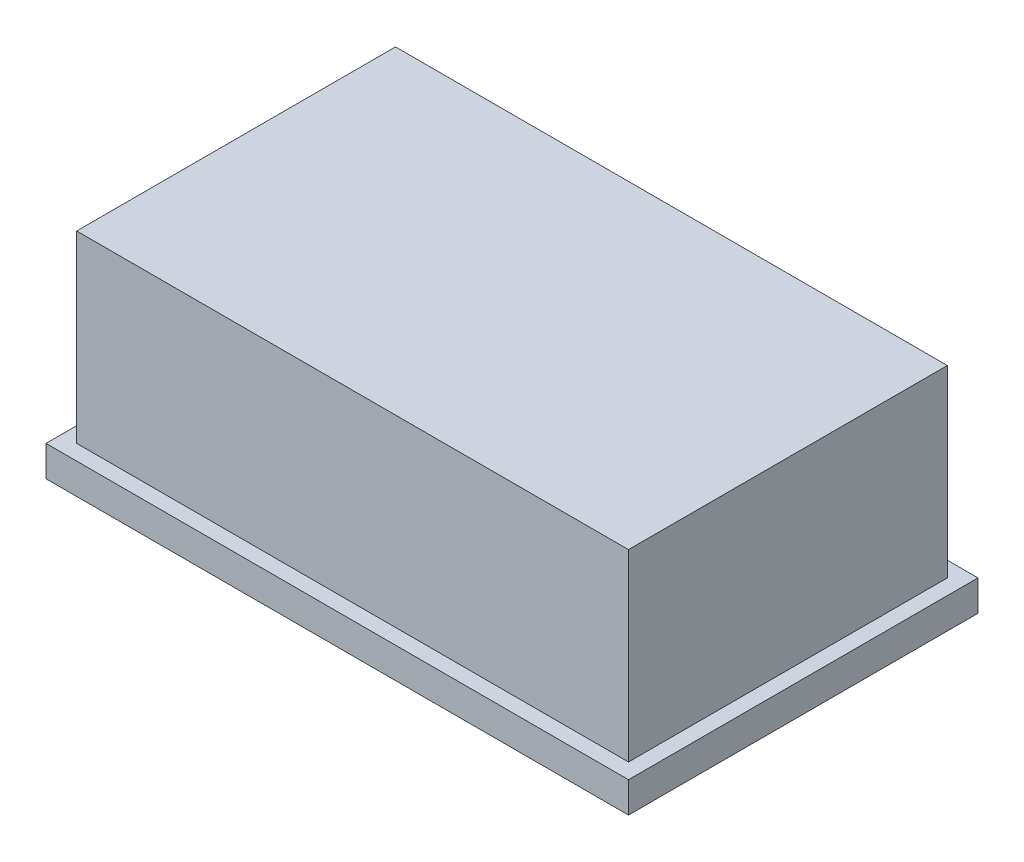
ISO-10303-21;
HEADER;
FILE_DESCRIPTION(('STEP AP214'),'2;1');
FILE_NAME('part.step','',(''),(''),'','','');
FILE_SCHEMA(('AUTOMOTIVE_DESIGN { 1 0 10303 214 1 1 1 1 }'));
ENDSEC;
DATA;
#1=APPLICATION_CONTEXT('core data for automotive mechanical design processes');
#2=APPLICATION_PROTOCOL_DEFINITION('international standard','automotive_design',2000,#1);
#3=PRODUCT_CONTEXT('',#1,'mechanical');
#4=PRODUCT('Part','Part','',(#3));
#5=PRODUCT_RELATED_PRODUCT_CATEGORY('part','',(#4));
#6=PRODUCT_DEFINITION_FORMATION('','',#4);
#7=PRODUCT_DEFINITION_CONTEXT('part definition',#1,'design');
#8=PRODUCT_DEFINITION('design','',#6,#7);
#9=PRODUCT_DEFINITION_SHAPE('','',#8);
#10=(LENGTH_UNIT() NAMED_UNIT(*) SI_UNIT(.MILLI.,.METRE.));
#11=(NAMED_UNIT(*) PLANE_ANGLE_UNIT() SI_UNIT($,.RADIAN.));
#12=(NAMED_UNIT(*) SI_UNIT($,.STERADIAN.) SOLID_ANGLE_UNIT());
#13=UNCERTAINTY_MEASURE_WITH_UNIT(LENGTH_MEASURE(1.E-05),#10,'distance_accuracy_value','');
#14=(GEOMETRIC_REPRESENTATION_CONTEXT(3) GLOBAL_UNCERTAINTY_ASSIGNED_CONTEXT((#13)) GLOBAL_UNIT_ASSIGNED_CONTEXT((#10,
#11,#12)) REPRESENTATION_CONTEXT('',''));
#15=CARTESIAN_POINT('',(0.,0.,0.));
#16=DIRECTION('',(0.,0.,1.));
#17=DIRECTION('',(1.,0.,0.));
#18=AXIS2_PLACEMENT_3D('',#15,#16,#17);
#19=CARTESIAN_POINT('',(0.,2.5,0.));
#20=DIRECTION('',(0.,-1.,0.));
#21=DIRECTION('',(0.,0.,-1.));
#22=AXIS2_PLACEMENT_3D('',#19,#20,#21);
#23=PLANE('',#22);
#24=DIRECTION('',(0.,0.,1.));
#25=VECTOR('',#24,1.);
#26=CARTESIAN_POINT('',(0.,2.5,0.));
#27=LINE('',#26,#25);
#28=CARTESIAN_POINT('',(0.,2.5,-28.5));
#29=VERTEX_POINT('',#28);
#30=CARTESIAN_POINT('',(0.,2.5,0.));
#31=VERTEX_POINT('',#30);
#32=EDGE_CURVE('E236',#29,#31,#27,.T.);
#33=ORIENTED_EDGE('',*,*,#32,.T.);
#34=DIRECTION('',(1.,0.,0.));
#35=VECTOR('',#34,1.);
#36=CARTESIAN_POINT('',(0.,2.5,0.));
#37=LINE('',#36,#35);
#38=CARTESIAN_POINT('',(47.5,2.5,0.));
#39=VERTEX_POINT('',#38);
#40=EDGE_CURVE('E240',#31,#39,#37,.T.);
#41=ORIENTED_EDGE('',*,*,#40,.T.);
#42=DIRECTION('',(0.,0.,-1.));
#43=VECTOR('',#42,1.);
#44=CARTESIAN_POINT('',(47.5,2.5,0.));
#45=LINE('',#44,#43);
#46=CARTESIAN_POINT('',(47.5,2.5,-28.5));
#47=VERTEX_POINT('',#46);
#48=EDGE_CURVE('E244',#39,#47,#45,.T.);
#49=ORIENTED_EDGE('',*,*,#48,.T.);
#50=DIRECTION('',(-1.,0.,0.));
#51=VECTOR('',#50,1.);
#52=CARTESIAN_POINT('',(0.,2.5,-28.5));
#53=LINE('',#52,#51);
#54=EDGE_CURVE('E247',#47,#29,#53,.T.);
#55=ORIENTED_EDGE('',*,*,#54,.T.);
#56=EDGE_LOOP('',(#33,#41,#49,#55));
#57=FACE_BOUND('',#56,.T.);
#58=DIRECTION('',(0.,0.,-1.));
#59=VECTOR('',#58,1.);
#60=CARTESIAN_POINT('',(46.25,2.5,-1.25));
#61=LINE('',#60,#59);
#62=CARTESIAN_POINT('',(46.25,2.5,-1.25));
#63=VERTEX_POINT('',#62);
#64=CARTESIAN_POINT('',(46.25,2.5,-27.25));
#65=VERTEX_POINT('',#64);
#66=EDGE_CURVE('E185',#63,#65,#61,.T.);
#67=ORIENTED_EDGE('',*,*,#66,.F.);
#68=DIRECTION('',(1.,0.,0.));
#69=VECTOR('',#68,1.);
#70=CARTESIAN_POINT('',(1.24999999999999,2.5,-1.25));
#71=LINE('',#70,#69);
#72=CARTESIAN_POINT('',(1.24999999999999,2.5,-1.25));
#73=VERTEX_POINT('',#72);
#74=EDGE_CURVE('E196',#73,#63,#71,.T.);
#75=ORIENTED_EDGE('',*,*,#74,.F.);
#76=DIRECTION('',(0.,0.,1.));
#77=VECTOR('',#76,1.);
#78=CARTESIAN_POINT('',(1.24999999999999,2.5,-1.25));
#79=LINE('',#78,#77);
#80=CARTESIAN_POINT('',(1.24999999999999,2.5,-27.25));
#81=VERTEX_POINT('',#80);
#82=EDGE_CURVE('E213',#81,#73,#79,.T.);
#83=ORIENTED_EDGE('',*,*,#82,.F.);
#84=DIRECTION('',(-1.,0.,0.));
#85=VECTOR('',#84,1.);
#86=CARTESIAN_POINT('',(1.24999999999999,2.5,-27.25));
#87=LINE('',#86,#85);
#88=EDGE_CURVE('E209',#65,#81,#87,.T.);
#89=ORIENTED_EDGE('',*,*,#88,.F.);
#90=EDGE_LOOP('',(#67,#75,#83,#89));
#91=FACE_BOUND('',#90,.T.);
#92=ADVANCED_FACE('F45',(#57,#91),#23,.F.);
#93=CARTESIAN_POINT('',(0.,2.5,0.));
#94=DIRECTION('',(1.,0.,0.));
#95=DIRECTION('',(0.,0.,-1.));
#96=AXIS2_PLACEMENT_3D('',#93,#94,#95);
#97=PLANE('',#96);
#98=DIRECTION('',(0.,0.,1.));
#99=VECTOR('',#98,1.);
#100=CARTESIAN_POINT('',(0.,0.,0.));
#101=LINE('',#100,#99);
#102=CARTESIAN_POINT('',(0.,0.,-28.5));
#103=VERTEX_POINT('',#102);
#104=CARTESIAN_POINT('',(0.,0.,0.));
#105=VERTEX_POINT('',#104);
#106=EDGE_CURVE('E235',#103,#105,#101,.T.);
#107=ORIENTED_EDGE('',*,*,#106,.T.);
#108=DIRECTION('',(0.,-1.,0.));
#109=VECTOR('',#108,1.);
#110=CARTESIAN_POINT('',(0.,2.5,0.));
#111=LINE('',#110,#109);
#112=EDGE_CURVE('E273',#31,#105,#111,.T.);
#113=ORIENTED_EDGE('',*,*,#112,.F.);
#114=ORIENTED_EDGE('',*,*,#32,.F.);
#115=DIRECTION('',(0.,-1.,0.));
#116=VECTOR('',#115,1.);
#117=CARTESIAN_POINT('',(0.,2.5,-28.5));
#118=LINE('',#117,#116);
#119=EDGE_CURVE('E250',#29,#103,#118,.T.);
#120=ORIENTED_EDGE('',*,*,#119,.T.);
#121=EDGE_LOOP('',(#107,#113,#114,#120));
#122=FACE_BOUND('',#121,.T.);
#123=ADVANCED_FACE('F329',(#122),#97,.F.);
#124=CARTESIAN_POINT('',(0.,2.5,0.));
#125=DIRECTION('',(0.,0.,-1.));
#126=DIRECTION('',(-1.,0.,0.));
#127=AXIS2_PLACEMENT_3D('',#124,#125,#126);
#128=PLANE('',#127);
#129=DIRECTION('',(1.,0.,0.));
#130=VECTOR('',#129,1.);
#131=CARTESIAN_POINT('',(0.,0.,0.));
#132=LINE('',#131,#130);
#133=CARTESIAN_POINT('',(47.5,0.,0.));
#134=VERTEX_POINT('',#133);
#135=EDGE_CURVE('E254',#105,#134,#132,.T.);
#136=ORIENTED_EDGE('',*,*,#135,.T.);
#137=DIRECTION('',(0.,-1.,0.));
#138=VECTOR('',#137,1.);
#139=CARTESIAN_POINT('',(47.5,2.5,0.));
#140=LINE('',#139,#138);
#141=EDGE_CURVE('E269',#39,#134,#140,.T.);
#142=ORIENTED_EDGE('',*,*,#141,.F.);
#143=ORIENTED_EDGE('',*,*,#40,.F.);
#144=ORIENTED_EDGE('',*,*,#112,.T.);
#145=EDGE_LOOP('',(#136,#142,#143,#144));
#146=FACE_BOUND('',#145,.T.);
#147=ADVANCED_FACE('F335',(#146),#128,.F.);
#148=CARTESIAN_POINT('',(47.5,2.5,0.));
#149=DIRECTION('',(-1.,0.,0.));
#150=DIRECTION('',(0.,0.,1.));
#151=AXIS2_PLACEMENT_3D('',#148,#149,#150);
#152=PLANE('',#151);
#153=DIRECTION('',(0.,0.,-1.));
#154=VECTOR('',#153,1.);
#155=CARTESIAN_POINT('',(47.5,0.,0.));
#156=LINE('',#155,#154);
#157=CARTESIAN_POINT('',(47.5,0.,-28.5));
#158=VERTEX_POINT('',#157);
#159=EDGE_CURVE('E257',#134,#158,#156,.T.);
#160=ORIENTED_EDGE('',*,*,#159,.T.);
#161=DIRECTION('',(0.,-1.,0.));
#162=VECTOR('',#161,1.);
#163=CARTESIAN_POINT('',(47.5,2.5,-28.5));
#164=LINE('',#163,#162);
#165=EDGE_CURVE('E265',#47,#158,#164,.T.);
#166=ORIENTED_EDGE('',*,*,#165,.F.);
#167=ORIENTED_EDGE('',*,*,#48,.F.);
#168=ORIENTED_EDGE('',*,*,#141,.T.);
#169=EDGE_LOOP('',(#160,#166,#167,#168));
#170=FACE_BOUND('',#169,.T.);
#171=ADVANCED_FACE('F350',(#170),#152,.F.);
#172=CARTESIAN_POINT('',(0.,2.5,-28.5));
#173=DIRECTION('',(0.,0.,1.));
#174=DIRECTION('',(1.,0.,0.));
#175=AXIS2_PLACEMENT_3D('',#172,#173,#174);
#176=PLANE('',#175);
#177=DIRECTION('',(-1.,0.,0.));
#178=VECTOR('',#177,1.);
#179=CARTESIAN_POINT('',(0.,0.,-28.5));
#180=LINE('',#179,#178);
#181=EDGE_CURVE('E241',#158,#103,#180,.T.);
#182=ORIENTED_EDGE('',*,*,#181,.T.);
#183=ORIENTED_EDGE('',*,*,#119,.F.);
#184=ORIENTED_EDGE('',*,*,#54,.F.);
#185=ORIENTED_EDGE('',*,*,#165,.T.);
#186=EDGE_LOOP('',(#182,#183,#184,#185));
#187=FACE_BOUND('',#186,.T.);
#188=ADVANCED_FACE('F346',(#187),#176,.F.);
#189=CARTESIAN_POINT('',(0.,0.,0.));
#190=DIRECTION('',(0.,-1.,0.));
#191=DIRECTION('',(0.,0.,-1.));
#192=AXIS2_PLACEMENT_3D('',#189,#190,#191);
#193=PLANE('',#192);
#194=DIRECTION('',(1.,0.,0.));
#195=VECTOR('',#194,1.);
#196=CARTESIAN_POINT('',(41.75,0.,-3.24999999999999));
#197=LINE('',#196,#195);
#198=CARTESIAN_POINT('',(3.74999999999999,0.,-3.24999999999999));
#199=VERTEX_POINT('',#198);
#200=CARTESIAN_POINT('',(43.75,0.,-3.24999999999999));
#201=VERTEX_POINT('',#200);
#202=EDGE_CURVE('E279',#199,#201,#197,.T.);
#203=ORIENTED_EDGE('',*,*,#202,.T.);
#204=DIRECTION('',(0.,0.,-1.));
#205=VECTOR('',#204,1.);
#206=CARTESIAN_POINT('',(43.75,0.,-23.25));
#207=LINE('',#206,#205);
#208=CARTESIAN_POINT('',(43.75,0.,-25.25));
#209=VERTEX_POINT('',#208);
#210=EDGE_CURVE('E288',#201,#209,#207,.T.);
#211=ORIENTED_EDGE('',*,*,#210,.T.);
#212=DIRECTION('',(-1.,0.,0.));
#213=VECTOR('',#212,1.);
#214=CARTESIAN_POINT('',(5.75,0.,-25.25));
#215=LINE('',#214,#213);
#216=CARTESIAN_POINT('',(3.74999999999999,0.,-25.25));
#217=VERTEX_POINT('',#216);
#218=EDGE_CURVE('E285',#209,#217,#215,.T.);
#219=ORIENTED_EDGE('',*,*,#218,.T.);
#220=DIRECTION('',(0.,0.,1.));
#221=VECTOR('',#220,1.);
#222=CARTESIAN_POINT('',(3.74999999999999,0.,-5.25));
#223=LINE('',#222,#221);
#224=EDGE_CURVE('E282',#217,#199,#223,.T.);
#225=ORIENTED_EDGE('',*,*,#224,.T.);
#226=EDGE_LOOP('',(#203,#211,#219,#225));
#227=FACE_BOUND('',#226,.T.);
#228=ORIENTED_EDGE('',*,*,#106,.F.);
#229=ORIENTED_EDGE('',*,*,#181,.F.);
#230=ORIENTED_EDGE('',*,*,#159,.F.);
#231=ORIENTED_EDGE('',*,*,#135,.F.);
#232=EDGE_LOOP('',(#228,#229,#230,#231));
#233=FACE_BOUND('',#232,.T.);
#234=ADVANCED_FACE('F343',(#227,#233),#193,.T.);
#235=CARTESIAN_POINT('',(46.25,17.5,-1.25));
#236=DIRECTION('',(-1.,0.,0.));
#237=DIRECTION('',(0.,0.,1.));
#238=AXIS2_PLACEMENT_3D('',#235,#236,#237);
#239=PLANE('',#238);
#240=ORIENTED_EDGE('',*,*,#66,.T.);
#241=DIRECTION('',(0.,-1.,0.));
#242=VECTOR('',#241,1.);
#243=CARTESIAN_POINT('',(46.25,17.5,-27.25));
#244=LINE('',#243,#242);
#245=CARTESIAN_POINT('',(46.25,17.5,-27.25));
#246=VERTEX_POINT('',#245);
#247=EDGE_CURVE('E231',#246,#65,#244,.T.);
#248=ORIENTED_EDGE('',*,*,#247,.F.);
#249=DIRECTION('',(0.,0.,-1.));
#250=VECTOR('',#249,1.);
#251=CARTESIAN_POINT('',(46.25,17.5,-1.25));
#252=LINE('',#251,#250);
#253=CARTESIAN_POINT('',(46.25,17.5,-1.25));
#254=VERTEX_POINT('',#253);
#255=EDGE_CURVE('E191',#254,#246,#252,.T.);
#256=ORIENTED_EDGE('',*,*,#255,.F.);
#257=DIRECTION('',(0.,-1.,0.));
#258=VECTOR('',#257,1.);
#259=CARTESIAN_POINT('',(46.25,17.5,-1.25));
#260=LINE('',#259,#258);
#261=EDGE_CURVE('E205',#254,#63,#260,.T.);
#262=ORIENTED_EDGE('',*,*,#261,.T.);
#263=EDGE_LOOP('',(#240,#248,#256,#262));
#264=FACE_BOUND('',#263,.T.);
#265=ADVANCED_FACE('F341',(#264),#239,.F.);
#266=CARTESIAN_POINT('',(1.24999999999999,17.5,-27.25));
#267=DIRECTION('',(0.,0.,1.));
#268=DIRECTION('',(1.,0.,0.));
#269=AXIS2_PLACEMENT_3D('',#266,#267,#268);
#270=PLANE('',#269);
#271=ORIENTED_EDGE('',*,*,#88,.T.);
#272=DIRECTION('',(0.,-1.,0.));
#273=VECTOR('',#272,1.);
#274=CARTESIAN_POINT('',(1.24999999999999,17.5,-27.25));
#275=LINE('',#274,#273);
#276=CARTESIAN_POINT('',(1.24999999999999,17.5,-27.25));
#277=VERTEX_POINT('',#276);
#278=EDGE_CURVE('E227',#277,#81,#275,.T.);
#279=ORIENTED_EDGE('',*,*,#278,.F.);
#280=DIRECTION('',(-1.,0.,0.));
#281=VECTOR('',#280,1.);
#282=CARTESIAN_POINT('',(1.24999999999999,17.5,-27.25));
#283=LINE('',#282,#281);
#284=EDGE_CURVE('E195',#246,#277,#283,.T.);
#285=ORIENTED_EDGE('',*,*,#284,.F.);
#286=ORIENTED_EDGE('',*,*,#247,.T.);
#287=EDGE_LOOP('',(#271,#279,#285,#286));
#288=FACE_BOUND('',#287,.T.);
#289=ADVANCED_FACE('F471',(#288),#270,.F.);
#290=CARTESIAN_POINT('',(1.24999999999999,17.5,-1.25));
#291=DIRECTION('',(1.,0.,0.));
#292=DIRECTION('',(0.,0.,-1.));
#293=AXIS2_PLACEMENT_3D('',#290,#291,#292);
#294=PLANE('',#293);
#295=ORIENTED_EDGE('',*,*,#82,.T.);
#296=DIRECTION('',(0.,-1.,0.));
#297=VECTOR('',#296,1.);
#298=CARTESIAN_POINT('',(1.24999999999999,17.5,-1.25));
#299=LINE('',#298,#297);
#300=CARTESIAN_POINT('',(1.24999999999999,17.5,-1.25));
#301=VERTEX_POINT('',#300);
#302=EDGE_CURVE('E223',#301,#73,#299,.T.);
#303=ORIENTED_EDGE('',*,*,#302,.F.);
#304=DIRECTION('',(0.,0.,1.));
#305=VECTOR('',#304,1.);
#306=CARTESIAN_POINT('',(1.24999999999999,17.5,-1.25));
#307=LINE('',#306,#305);
#308=EDGE_CURVE('E199',#277,#301,#307,.T.);
#309=ORIENTED_EDGE('',*,*,#308,.F.);
#310=ORIENTED_EDGE('',*,*,#278,.T.);
#311=EDGE_LOOP('',(#295,#303,#309,#310));
#312=FACE_BOUND('',#311,.T.);
#313=ADVANCED_FACE('F461',(#312),#294,.F.);
#314=CARTESIAN_POINT('',(1.24999999999999,17.5,-1.25));
#315=DIRECTION('',(0.,0.,-1.));
#316=DIRECTION('',(-1.,0.,0.));
#317=AXIS2_PLACEMENT_3D('',#314,#315,#316);
#318=PLANE('',#317);
#319=ORIENTED_EDGE('',*,*,#74,.T.);
#320=ORIENTED_EDGE('',*,*,#261,.F.);
#321=DIRECTION('',(1.,0.,0.));
#322=VECTOR('',#321,1.);
#323=CARTESIAN_POINT('',(1.24999999999999,17.5,-1.25));
#324=LINE('',#323,#322);
#325=EDGE_CURVE('E202',#301,#254,#324,.T.);
#326=ORIENTED_EDGE('',*,*,#325,.F.);
#327=ORIENTED_EDGE('',*,*,#302,.T.);
#328=EDGE_LOOP('',(#319,#320,#326,#327));
#329=FACE_BOUND('',#328,.T.);
#330=ADVANCED_FACE('F452',(#329),#318,.F.);
#331=CARTESIAN_POINT('',(0.,17.5,0.));
#332=DIRECTION('',(0.,-1.,0.));
#333=DIRECTION('',(0.,0.,-1.));
#334=AXIS2_PLACEMENT_3D('',#331,#332,#333);
#335=PLANE('',#334);
#336=ORIENTED_EDGE('',*,*,#255,.T.);
#337=ORIENTED_EDGE('',*,*,#284,.T.);
#338=ORIENTED_EDGE('',*,*,#308,.T.);
#339=ORIENTED_EDGE('',*,*,#325,.T.);
#340=EDGE_LOOP('',(#336,#337,#338,#339));
#341=FACE_BOUND('',#340,.T.);
#342=ADVANCED_FACE('F443',(#341),#335,.F.);
#343=CARTESIAN_POINT('',(41.75,3.,-23.25));
#344=DIRECTION('',(1.,0.,0.));
#345=DIRECTION('',(0.,0.,-1.));
#346=AXIS2_PLACEMENT_3D('',#343,#344,#345);
#347=PLANE('',#346);
#348=DIRECTION('',(0.,-1.,0.));
#349=VECTOR('',#348,1.);
#350=CARTESIAN_POINT('',(41.75,3.,-23.25));
#351=LINE('',#350,#349);
#352=CARTESIAN_POINT('',(41.75,3.,-23.25));
#353=VERTEX_POINT('',#352);
#354=CARTESIAN_POINT('',(41.75,2.,-23.25));
#355=VERTEX_POINT('',#354);
#356=EDGE_CURVE('E182',#353,#355,#351,.T.);
#357=ORIENTED_EDGE('',*,*,#356,.T.);
#358=DIRECTION('',(0.,0.,1.));
#359=VECTOR('',#358,1.);
#360=CARTESIAN_POINT('',(41.75,2.,-5.25));
#361=LINE('',#360,#359);
#362=CARTESIAN_POINT('',(41.75,2.,-5.25));
#363=VERTEX_POINT('',#362);
#364=EDGE_CURVE('E156',#355,#363,#361,.T.);
#365=ORIENTED_EDGE('',*,*,#364,.T.);
#366=DIRECTION('',(0.,-1.,0.));
#367=VECTOR('',#366,1.);
#368=CARTESIAN_POINT('',(41.75,3.,-5.25));
#369=LINE('',#368,#367);
#370=CARTESIAN_POINT('',(41.75,3.,-5.25));
#371=VERTEX_POINT('',#370);
#372=EDGE_CURVE('E148',#371,#363,#369,.T.);
#373=ORIENTED_EDGE('',*,*,#372,.F.);
#374=DIRECTION('',(0.,0.,1.));
#375=VECTOR('',#374,1.);
#376=CARTESIAN_POINT('',(41.75,3.,-23.25));
#377=LINE('',#376,#375);
#378=EDGE_CURVE('E153',#353,#371,#377,.T.);
#379=ORIENTED_EDGE('',*,*,#378,.F.);
#380=EDGE_LOOP('',(#357,#365,#373,#379));
#381=FACE_BOUND('',#380,.T.);
#382=ADVANCED_FACE('F151',(#381),#347,.F.);
#383=CARTESIAN_POINT('',(5.75,3.,-23.25));
#384=DIRECTION('',(0.,0.,-1.));
#385=DIRECTION('',(-1.,0.,0.));
#386=AXIS2_PLACEMENT_3D('',#383,#384,#385);
#387=PLANE('',#386);
#388=DIRECTION('',(0.,-1.,0.));
#389=VECTOR('',#388,1.);
#390=CARTESIAN_POINT('',(5.75,3.,-23.25));
#391=LINE('',#390,#389);
#392=CARTESIAN_POINT('',(5.75,3.,-23.25));
#393=VERTEX_POINT('',#392);
#394=CARTESIAN_POINT('',(5.75,2.,-23.25));
#395=VERTEX_POINT('',#394);
#396=EDGE_CURVE('E186',#393,#395,#391,.T.);
#397=ORIENTED_EDGE('',*,*,#396,.T.);
#398=DIRECTION('',(1.,0.,0.));
#399=VECTOR('',#398,1.);
#400=CARTESIAN_POINT('',(41.75,2.,-23.25));
#401=LINE('',#400,#399);
#402=EDGE_CURVE('E292',#395,#355,#401,.T.);
#403=ORIENTED_EDGE('',*,*,#402,.T.);
#404=ORIENTED_EDGE('',*,*,#356,.F.);
#405=DIRECTION('',(1.,0.,0.));
#406=VECTOR('',#405,1.);
#407=CARTESIAN_POINT('',(5.75,3.,-23.25));
#408=LINE('',#407,#406);
#409=EDGE_CURVE('E159',#393,#353,#408,.T.);
#410=ORIENTED_EDGE('',*,*,#409,.F.);
#411=EDGE_LOOP('',(#397,#403,#404,#410));
#412=FACE_BOUND('',#411,.T.);
#413=ADVANCED_FACE('F318',(#412),#387,.F.);
#414=CARTESIAN_POINT('',(5.75,3.,-23.25));
#415=DIRECTION('',(-1.,0.,0.));
#416=DIRECTION('',(0.,0.,1.));
#417=AXIS2_PLACEMENT_3D('',#414,#415,#416);
#418=PLANE('',#417);
#419=DIRECTION('',(0.,-1.,0.));
#420=VECTOR('',#419,1.);
#421=CARTESIAN_POINT('',(5.75,3.,-5.25));
#422=LINE('',#421,#420);
#423=CARTESIAN_POINT('',(5.75,3.,-5.25));
#424=VERTEX_POINT('',#423);
#425=CARTESIAN_POINT('',(5.75,2.,-5.25));
#426=VERTEX_POINT('',#425);
#427=EDGE_CURVE('E158',#424,#426,#422,.T.);
#428=ORIENTED_EDGE('',*,*,#427,.T.);
#429=DIRECTION('',(0.,0.,-1.));
#430=VECTOR('',#429,1.);
#431=CARTESIAN_POINT('',(5.75,2.,-23.25));
#432=LINE('',#431,#430);
#433=EDGE_CURVE('E56',#426,#395,#432,.T.);
#434=ORIENTED_EDGE('',*,*,#433,.T.);
#435=ORIENTED_EDGE('',*,*,#396,.F.);
#436=DIRECTION('',(0.,0.,-1.));
#437=VECTOR('',#436,1.);
#438=CARTESIAN_POINT('',(5.75,3.,-23.25));
#439=LINE('',#438,#437);
#440=EDGE_CURVE('E168',#424,#393,#439,.T.);
#441=ORIENTED_EDGE('',*,*,#440,.F.);
#442=EDGE_LOOP('',(#428,#434,#435,#441));
#443=FACE_BOUND('',#442,.T.);
#444=ADVANCED_FACE('F319',(#443),#418,.F.);
#445=CARTESIAN_POINT('',(5.75,3.,-5.25));
#446=DIRECTION('',(0.,0.,1.));
#447=DIRECTION('',(1.,0.,0.));
#448=AXIS2_PLACEMENT_3D('',#445,#446,#447);
#449=PLANE('',#448);
#450=ORIENTED_EDGE('',*,*,#372,.T.);
#451=DIRECTION('',(-1.,0.,0.));
#452=VECTOR('',#451,1.);
#453=CARTESIAN_POINT('',(5.75,2.,-5.25));
#454=LINE('',#453,#452);
#455=EDGE_CURVE('E11',#363,#426,#454,.T.);
#456=ORIENTED_EDGE('',*,*,#455,.T.);
#457=ORIENTED_EDGE('',*,*,#427,.F.);
#458=DIRECTION('',(-1.,0.,0.));
#459=VECTOR('',#458,1.);
#460=CARTESIAN_POINT('',(5.75,3.,-5.25));
#461=LINE('',#460,#459);
#462=EDGE_CURVE('E162',#371,#424,#461,.T.);
#463=ORIENTED_EDGE('',*,*,#462,.F.);
#464=EDGE_LOOP('',(#450,#456,#457,#463));
#465=FACE_BOUND('',#464,.T.);
#466=ADVANCED_FACE('F163',(#465),#449,.F.);
#467=CARTESIAN_POINT('',(0.,3.,0.));
#468=DIRECTION('',(0.,1.,0.));
#469=DIRECTION('',(0.,0.,1.));
#470=AXIS2_PLACEMENT_3D('',#467,#468,#469);
#471=PLANE('',#470);
#472=ORIENTED_EDGE('',*,*,#378,.T.);
#473=ORIENTED_EDGE('',*,*,#462,.T.);
#474=ORIENTED_EDGE('',*,*,#440,.T.);
#475=ORIENTED_EDGE('',*,*,#409,.T.);
#476=EDGE_LOOP('',(#472,#473,#474,#475));
#477=FACE_BOUND('',#476,.T.);
#478=ADVANCED_FACE('F170',(#477),#471,.F.);
#479=CARTESIAN_POINT('',(5.75,2.,-23.25));
#480=DIRECTION('',(0.707106781186546,-0.707106781186549,0.));
#481=DIRECTION('',(0.,0.,1.));
#482=AXIS2_PLACEMENT_3D('',#479,#480,#481);
#483=PLANE('',#482);
#484=DIRECTION('',(0.577350269189626,0.577350269189624,-0.577350269189626));
#485=VECTOR('',#484,1.);
#486=CARTESIAN_POINT('',(11.75,7.99999999999999,-11.25));
#487=LINE('',#486,#485);
#488=EDGE_CURVE('E176',#199,#426,#487,.T.);
#489=ORIENTED_EDGE('',*,*,#488,.F.);
#490=ORIENTED_EDGE('',*,*,#224,.F.);
#491=DIRECTION('',(0.577350269189626,0.577350269189624,0.577350269189626));
#492=VECTOR('',#491,1.);
#493=CARTESIAN_POINT('',(5.75,2.,-23.25));
#494=LINE('',#493,#492);
#495=EDGE_CURVE('E50',#395,#217,#494,.F.);
#496=ORIENTED_EDGE('',*,*,#495,.F.);
#497=ORIENTED_EDGE('',*,*,#433,.F.);
#498=EDGE_LOOP('',(#489,#490,#496,#497));
#499=FACE_BOUND('',#498,.T.);
#500=ADVANCED_FACE('F48',(#499),#483,.T.);
#501=CARTESIAN_POINT('',(5.75,2.,-23.25));
#502=DIRECTION('',(0.,-0.707106781186549,0.707106781186546));
#503=DIRECTION('',(-1.,0.,0.));
#504=AXIS2_PLACEMENT_3D('',#501,#502,#503);
#505=PLANE('',#504);
#506=ORIENTED_EDGE('',*,*,#495,.T.);
#507=ORIENTED_EDGE('',*,*,#218,.F.);
#508=DIRECTION('',(-0.577350269189626,0.577350269189624,0.577350269189626));
#509=VECTOR('',#508,1.);
#510=CARTESIAN_POINT('',(41.75,2.,-23.25));
#511=LINE('',#510,#509);
#512=EDGE_CURVE('E300',#355,#209,#511,.F.);
#513=ORIENTED_EDGE('',*,*,#512,.F.);
#514=ORIENTED_EDGE('',*,*,#402,.F.);
#515=EDGE_LOOP('',(#506,#507,#513,#514));
#516=FACE_BOUND('',#515,.T.);
#517=ADVANCED_FACE('F316',(#516),#505,.T.);
#518=CARTESIAN_POINT('',(5.75,2.,-5.25));
#519=DIRECTION('',(0.,-0.707106781186549,-0.707106781186546));
#520=DIRECTION('',(1.,0.,0.));
#521=AXIS2_PLACEMENT_3D('',#518,#519,#520);
#522=PLANE('',#521);
#523=ORIENTED_EDGE('',*,*,#488,.T.);
#524=ORIENTED_EDGE('',*,*,#455,.F.);
#525=DIRECTION('',(0.577350269189626,-0.577350269189624,0.577350269189626));
#526=VECTOR('',#525,1.);
#527=CARTESIAN_POINT('',(35.75,7.99999999999999,-11.25));
#528=LINE('',#527,#526);
#529=EDGE_CURVE('E297',#201,#363,#528,.F.);
#530=ORIENTED_EDGE('',*,*,#529,.F.);
#531=ORIENTED_EDGE('',*,*,#202,.F.);
#532=EDGE_LOOP('',(#523,#524,#530,#531));
#533=FACE_BOUND('',#532,.T.);
#534=ADVANCED_FACE('F307',(#533),#522,.T.);
#535=CARTESIAN_POINT('',(41.75,2.,-23.25));
#536=DIRECTION('',(-0.707106781186546,-0.707106781186549,0.));
#537=DIRECTION('',(0.,0.,-1.));
#538=AXIS2_PLACEMENT_3D('',#535,#536,#537);
#539=PLANE('',#538);
#540=ORIENTED_EDGE('',*,*,#512,.T.);
#541=ORIENTED_EDGE('',*,*,#210,.F.);
#542=ORIENTED_EDGE('',*,*,#529,.T.);
#543=ORIENTED_EDGE('',*,*,#364,.F.);
#544=EDGE_LOOP('',(#540,#541,#542,#543));
#545=FACE_BOUND('',#544,.T.);
#546=ADVANCED_FACE('F359',(#545),#539,.T.);
#547=CLOSED_SHELL('',(#92,#123,#147,#171,#188,#234,#265,#289,#313,#330,#342,#382,#413,#444,#466,
#478,#500,#517,#534,#546));
#548=MANIFOLD_SOLID_BREP('B2',#547);
#549=ADVANCED_BREP_SHAPE_REPRESENTATION('',(#18,#548),#14);
#550=SHAPE_DEFINITION_REPRESENTATION(#9,#549);
ENDSEC;
END-ISO-10303-21;
